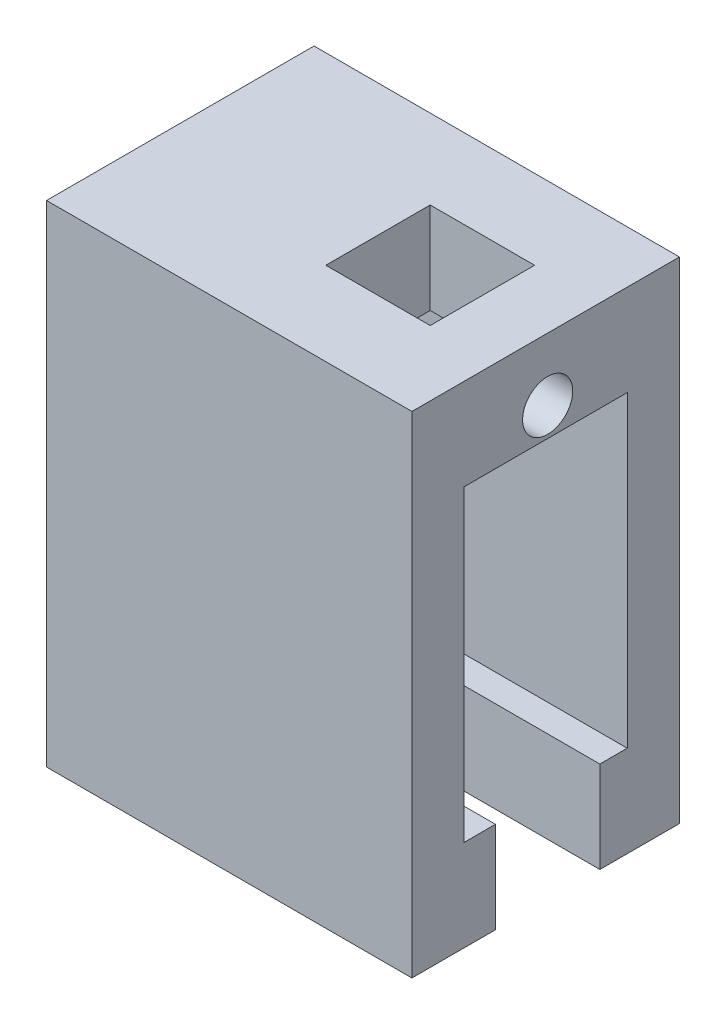
ISO-10303-21;
HEADER;
FILE_DESCRIPTION(('STEP AP214'),'2;1');
FILE_NAME('part.step','',(''),(''),'','','');
FILE_SCHEMA(('AUTOMOTIVE_DESIGN { 1 0 10303 214 1 1 1 1 }'));
ENDSEC;
DATA;
#1=APPLICATION_CONTEXT('core data for automotive mechanical design processes');
#2=APPLICATION_PROTOCOL_DEFINITION('international standard','automotive_design',2000,#1);
#3=PRODUCT_CONTEXT('',#1,'mechanical');
#4=PRODUCT('Part','Part','',(#3));
#5=PRODUCT_RELATED_PRODUCT_CATEGORY('part','',(#4));
#6=PRODUCT_DEFINITION_FORMATION('','',#4);
#7=PRODUCT_DEFINITION_CONTEXT('part definition',#1,'design');
#8=PRODUCT_DEFINITION('design','',#6,#7);
#9=PRODUCT_DEFINITION_SHAPE('','',#8);
#10=(LENGTH_UNIT() NAMED_UNIT(*) SI_UNIT(.MILLI.,.METRE.));
#11=(NAMED_UNIT(*) PLANE_ANGLE_UNIT() SI_UNIT($,.RADIAN.));
#12=(NAMED_UNIT(*) SI_UNIT($,.STERADIAN.) SOLID_ANGLE_UNIT());
#13=UNCERTAINTY_MEASURE_WITH_UNIT(LENGTH_MEASURE(1.E-05),#10,'distance_accuracy_value','');
#14=(GEOMETRIC_REPRESENTATION_CONTEXT(3) GLOBAL_UNCERTAINTY_ASSIGNED_CONTEXT((#13)) GLOBAL_UNIT_ASSIGNED_CONTEXT((#10,
#11,#12)) REPRESENTATION_CONTEXT('',''));
#15=CARTESIAN_POINT('',(0.,0.,0.));
#16=DIRECTION('',(0.,0.,1.));
#17=DIRECTION('',(1.,0.,0.));
#18=AXIS2_PLACEMENT_3D('',#15,#16,#17);
#19=CARTESIAN_POINT('',(28.,0.,0.));
#20=DIRECTION('',(-1.,0.,0.));
#21=DIRECTION('',(0.,0.,1.));
#22=AXIS2_PLACEMENT_3D('',#19,#20,#21);
#23=PLANE('',#22);
#24=CARTESIAN_POINT('',(28.,13.45,0.));
#25=DIRECTION('',(1.,0.,0.));
#26=DIRECTION('',(0.,0.,-1.));
#27=AXIS2_PLACEMENT_3D('',#24,#25,#26);
#28=CIRCLE('',#27,1.92);
#29=CARTESIAN_POINT('',(28.,13.45,-1.92));
#30=VERTEX_POINT('',#29);
#31=EDGE_CURVE('E214',#30,#30,#28,.T.);
#32=ORIENTED_EDGE('',*,*,#31,.F.);
#33=EDGE_LOOP('',(#32));
#34=FACE_BOUND('',#33,.T.);
#35=DIRECTION('',(0.,0.,-1.));
#36=VECTOR('',#35,1.);
#37=CARTESIAN_POINT('',(28.,-19.35,10.4));
#38=LINE('',#37,#36);
#39=CARTESIAN_POINT('',(28.,-19.35,10.4));
#40=VERTEX_POINT('',#39);
#41=CARTESIAN_POINT('',(28.,-19.35,4.));
#42=VERTEX_POINT('',#41);
#43=EDGE_CURVE('E260',#40,#42,#38,.T.);
#44=ORIENTED_EDGE('',*,*,#43,.T.);
#45=DIRECTION('',(0.,-1.,0.));
#46=VECTOR('',#45,1.);
#47=CARTESIAN_POINT('',(28.,-12.35,4.));
#48=LINE('',#47,#46);
#49=CARTESIAN_POINT('',(28.,-12.35,4.));
#50=VERTEX_POINT('',#49);
#51=EDGE_CURVE('E156',#50,#42,#48,.T.);
#52=ORIENTED_EDGE('',*,*,#51,.F.);
#53=DIRECTION('',(0.,0.,-1.));
#54=VECTOR('',#53,1.);
#55=CARTESIAN_POINT('',(28.,-12.35,6.4));
#56=LINE('',#55,#54);
#57=CARTESIAN_POINT('',(28.,-12.35,6.4));
#58=VERTEX_POINT('',#57);
#59=EDGE_CURVE('E227',#58,#50,#56,.T.);
#60=ORIENTED_EDGE('',*,*,#59,.F.);
#61=DIRECTION('',(0.,-1.,0.));
#62=VECTOR('',#61,1.);
#63=CARTESIAN_POINT('',(28.,-12.35,6.4));
#64=LINE('',#63,#62);
#65=CARTESIAN_POINT('',(28.,11.25,6.4));
#66=VERTEX_POINT('',#65);
#67=EDGE_CURVE('E223',#66,#58,#64,.T.);
#68=ORIENTED_EDGE('',*,*,#67,.F.);
#69=DIRECTION('',(0.,0.,1.));
#70=VECTOR('',#69,1.);
#71=CARTESIAN_POINT('',(28.,11.25,6.4));
#72=LINE('',#71,#70);
#73=CARTESIAN_POINT('',(28.,11.25,-6.1));
#74=VERTEX_POINT('',#73);
#75=EDGE_CURVE('E220',#74,#66,#72,.T.);
#76=ORIENTED_EDGE('',*,*,#75,.F.);
#77=DIRECTION('',(0.,1.,0.));
#78=VECTOR('',#77,1.);
#79=CARTESIAN_POINT('',(28.,-12.35,-6.1));
#80=LINE('',#79,#78);
#81=CARTESIAN_POINT('',(28.,-12.35,-6.1));
#82=VERTEX_POINT('',#81);
#83=EDGE_CURVE('E218',#82,#74,#80,.T.);
#84=ORIENTED_EDGE('',*,*,#83,.F.);
#85=CARTESIAN_POINT('',(28.,-12.35,-4.));
#86=VERTEX_POINT('',#85);
#87=EDGE_CURVE('E226',#86,#82,#56,.T.);
#88=ORIENTED_EDGE('',*,*,#87,.F.);
#89=DIRECTION('',(0.,1.,0.));
#90=VECTOR('',#89,1.);
#91=CARTESIAN_POINT('',(28.,-12.35,-4.));
#92=LINE('',#91,#90);
#93=CARTESIAN_POINT('',(28.,-19.35,-4.));
#94=VERTEX_POINT('',#93);
#95=EDGE_CURVE('E169',#94,#86,#92,.T.);
#96=ORIENTED_EDGE('',*,*,#95,.F.);
#97=CARTESIAN_POINT('',(28.,-19.35,-10.1));
#98=VERTEX_POINT('',#97);
#99=EDGE_CURVE('E259',#94,#98,#38,.T.);
#100=ORIENTED_EDGE('',*,*,#99,.T.);
#101=DIRECTION('',(0.,1.,0.));
#102=VECTOR('',#101,1.);
#103=CARTESIAN_POINT('',(28.,-19.35,-10.1));
#104=LINE('',#103,#102);
#105=CARTESIAN_POINT('',(28.,18.25,-10.1));
#106=VERTEX_POINT('',#105);
#107=EDGE_CURVE('E251',#98,#106,#104,.T.);
#108=ORIENTED_EDGE('',*,*,#107,.T.);
#109=DIRECTION('',(0.,0.,1.));
#110=VECTOR('',#109,1.);
#111=CARTESIAN_POINT('',(28.,18.25,10.4));
#112=LINE('',#111,#110);
#113=CARTESIAN_POINT('',(28.,18.25,10.4));
#114=VERTEX_POINT('',#113);
#115=EDGE_CURVE('E254',#106,#114,#112,.T.);
#116=ORIENTED_EDGE('',*,*,#115,.T.);
#117=DIRECTION('',(0.,-1.,0.));
#118=VECTOR('',#117,1.);
#119=CARTESIAN_POINT('',(28.,-19.35,10.4));
#120=LINE('',#119,#118);
#121=EDGE_CURVE('E257',#114,#40,#120,.T.);
#122=ORIENTED_EDGE('',*,*,#121,.T.);
#123=EDGE_LOOP('',(#44,#52,#60,#68,#76,#84,#88,#96,#100,#108,#116,#122));
#124=FACE_BOUND('',#123,.T.);
#125=ADVANCED_FACE('F37',(#34,#124),#23,.F.);
#126=CARTESIAN_POINT('',(0.,0.,0.));
#127=DIRECTION('',(-1.,0.,0.));
#128=DIRECTION('',(0.,0.,1.));
#129=AXIS2_PLACEMENT_3D('',#126,#127,#128);
#130=PLANE('',#129);
#131=DIRECTION('',(0.,1.,0.));
#132=VECTOR('',#131,1.);
#133=CARTESIAN_POINT('',(0.,-19.35,-10.1));
#134=LINE('',#133,#132);
#135=CARTESIAN_POINT('',(0.,-19.35,-10.1));
#136=VERTEX_POINT('',#135);
#137=CARTESIAN_POINT('',(0.,18.25,-10.1));
#138=VERTEX_POINT('',#137);
#139=EDGE_CURVE('E250',#136,#138,#134,.T.);
#140=ORIENTED_EDGE('',*,*,#139,.F.);
#141=DIRECTION('',(0.,0.,-1.));
#142=VECTOR('',#141,1.);
#143=CARTESIAN_POINT('',(0.,-19.35,10.4));
#144=LINE('',#143,#142);
#145=CARTESIAN_POINT('',(0.,-19.35,10.4));
#146=VERTEX_POINT('',#145);
#147=EDGE_CURVE('E255',#146,#136,#144,.T.);
#148=ORIENTED_EDGE('',*,*,#147,.F.);
#149=DIRECTION('',(0.,-1.,0.));
#150=VECTOR('',#149,1.);
#151=CARTESIAN_POINT('',(0.,-19.35,10.4));
#152=LINE('',#151,#150);
#153=CARTESIAN_POINT('',(0.,18.25,10.4));
#154=VERTEX_POINT('',#153);
#155=EDGE_CURVE('E267',#154,#146,#152,.T.);
#156=ORIENTED_EDGE('',*,*,#155,.F.);
#157=DIRECTION('',(0.,0.,1.));
#158=VECTOR('',#157,1.);
#159=CARTESIAN_POINT('',(0.,18.25,10.4));
#160=LINE('',#159,#158);
#161=EDGE_CURVE('E265',#138,#154,#160,.T.);
#162=ORIENTED_EDGE('',*,*,#161,.F.);
#163=EDGE_LOOP('',(#140,#148,#156,#162));
#164=FACE_BOUND('',#163,.T.);
#165=DIRECTION('',(0.,0.,-1.));
#166=VECTOR('',#165,1.);
#167=CARTESIAN_POINT('',(0.,-12.35,6.4));
#168=LINE('',#167,#166);
#169=CARTESIAN_POINT('',(0.,-12.35,6.4));
#170=VERTEX_POINT('',#169);
#171=CARTESIAN_POINT('',(0.,-12.35,-6.1));
#172=VERTEX_POINT('',#171);
#173=EDGE_CURVE('E221',#170,#172,#168,.T.);
#174=ORIENTED_EDGE('',*,*,#173,.T.);
#175=DIRECTION('',(0.,1.,0.));
#176=VECTOR('',#175,1.);
#177=CARTESIAN_POINT('',(0.,-12.35,-6.1));
#178=LINE('',#177,#176);
#179=CARTESIAN_POINT('',(0.,11.25,-6.1));
#180=VERTEX_POINT('',#179);
#181=EDGE_CURVE('E217',#172,#180,#178,.T.);
#182=ORIENTED_EDGE('',*,*,#181,.T.);
#183=DIRECTION('',(0.,0.,1.));
#184=VECTOR('',#183,1.);
#185=CARTESIAN_POINT('',(0.,11.25,6.4));
#186=LINE('',#185,#184);
#187=CARTESIAN_POINT('',(0.,11.25,6.4));
#188=VERTEX_POINT('',#187);
#189=EDGE_CURVE('E233',#180,#188,#186,.T.);
#190=ORIENTED_EDGE('',*,*,#189,.T.);
#191=DIRECTION('',(0.,-1.,0.));
#192=VECTOR('',#191,1.);
#193=CARTESIAN_POINT('',(0.,-12.35,6.4));
#194=LINE('',#193,#192);
#195=EDGE_CURVE('E236',#188,#170,#194,.T.);
#196=ORIENTED_EDGE('',*,*,#195,.T.);
#197=EDGE_LOOP('',(#174,#182,#190,#196));
#198=FACE_BOUND('',#197,.T.);
#199=ADVANCED_FACE('F286',(#164,#198),#130,.T.);
#200=CARTESIAN_POINT('',(28.,-19.35,-10.1));
#201=DIRECTION('',(0.,0.,1.));
#202=DIRECTION('',(1.,0.,0.));
#203=AXIS2_PLACEMENT_3D('',#200,#201,#202);
#204=PLANE('',#203);
#205=ORIENTED_EDGE('',*,*,#139,.T.);
#206=DIRECTION('',(-1.,0.,0.));
#207=VECTOR('',#206,1.);
#208=CARTESIAN_POINT('',(28.,18.25,-10.1));
#209=LINE('',#208,#207);
#210=EDGE_CURVE('E11',#106,#138,#209,.T.);
#211=ORIENTED_EDGE('',*,*,#210,.F.);
#212=ORIENTED_EDGE('',*,*,#107,.F.);
#213=DIRECTION('',(-1.,0.,0.));
#214=VECTOR('',#213,1.);
#215=CARTESIAN_POINT('',(28.,-19.35,-10.1));
#216=LINE('',#215,#214);
#217=EDGE_CURVE('E262',#98,#136,#216,.T.);
#218=ORIENTED_EDGE('',*,*,#217,.T.);
#219=EDGE_LOOP('',(#205,#211,#212,#218));
#220=FACE_BOUND('',#219,.T.);
#221=ADVANCED_FACE('F39',(#220),#204,.F.);
#222=CARTESIAN_POINT('',(28.,18.25,10.4));
#223=DIRECTION('',(0.,-1.,0.));
#224=DIRECTION('',(0.,0.,-1.));
#225=AXIS2_PLACEMENT_3D('',#222,#223,#224);
#226=PLANE('',#225);
#227=DIRECTION('',(-1.,0.,0.));
#228=VECTOR('',#227,1.);
#229=CARTESIAN_POINT('',(23.,18.25,-4.));
#230=LINE('',#229,#228);
#231=CARTESIAN_POINT('',(23.,18.25,-4.));
#232=VERTEX_POINT('',#231);
#233=CARTESIAN_POINT('',(15.,18.25,-4.));
#234=VERTEX_POINT('',#233);
#235=EDGE_CURVE('E61',#232,#234,#230,.T.);
#236=ORIENTED_EDGE('',*,*,#235,.F.);
#237=DIRECTION('',(0.,0.,1.));
#238=VECTOR('',#237,1.);
#239=CARTESIAN_POINT('',(23.,18.25,4.));
#240=LINE('',#239,#238);
#241=CARTESIAN_POINT('',(23.,18.25,4.));
#242=VERTEX_POINT('',#241);
#243=EDGE_CURVE('E192',#232,#242,#240,.T.);
#244=ORIENTED_EDGE('',*,*,#243,.T.);
#245=DIRECTION('',(-1.,0.,0.));
#246=VECTOR('',#245,1.);
#247=CARTESIAN_POINT('',(23.,18.25,4.));
#248=LINE('',#247,#246);
#249=CARTESIAN_POINT('',(15.,18.25,4.));
#250=VERTEX_POINT('',#249);
#251=EDGE_CURVE('E207',#242,#250,#248,.T.);
#252=ORIENTED_EDGE('',*,*,#251,.T.);
#253=DIRECTION('',(0.,0.,1.));
#254=VECTOR('',#253,1.);
#255=CARTESIAN_POINT('',(15.,18.25,4.));
#256=LINE('',#255,#254);
#257=EDGE_CURVE('E202',#234,#250,#256,.T.);
#258=ORIENTED_EDGE('',*,*,#257,.F.);
#259=EDGE_LOOP('',(#236,#244,#252,#258));
#260=FACE_BOUND('',#259,.T.);
#261=ORIENTED_EDGE('',*,*,#161,.T.);
#262=DIRECTION('',(-1.,0.,0.));
#263=VECTOR('',#262,1.);
#264=CARTESIAN_POINT('',(28.,18.25,10.4));
#265=LINE('',#264,#263);
#266=EDGE_CURVE('E46',#114,#154,#265,.T.);
#267=ORIENTED_EDGE('',*,*,#266,.F.);
#268=ORIENTED_EDGE('',*,*,#115,.F.);
#269=ORIENTED_EDGE('',*,*,#210,.T.);
#270=EDGE_LOOP('',(#261,#267,#268,#269));
#271=FACE_BOUND('',#270,.T.);
#272=ADVANCED_FACE('F320',(#260,#271),#226,.F.);
#273=CARTESIAN_POINT('',(28.,-19.35,10.4));
#274=DIRECTION('',(0.,0.,-1.));
#275=DIRECTION('',(-1.,0.,0.));
#276=AXIS2_PLACEMENT_3D('',#273,#274,#275);
#277=PLANE('',#276);
#278=ORIENTED_EDGE('',*,*,#155,.T.);
#279=DIRECTION('',(-1.,0.,0.));
#280=VECTOR('',#279,1.);
#281=CARTESIAN_POINT('',(28.,-19.35,10.4));
#282=LINE('',#281,#280);
#283=EDGE_CURVE('E272',#40,#146,#282,.T.);
#284=ORIENTED_EDGE('',*,*,#283,.F.);
#285=ORIENTED_EDGE('',*,*,#121,.F.);
#286=ORIENTED_EDGE('',*,*,#266,.T.);
#287=EDGE_LOOP('',(#278,#284,#285,#286));
#288=FACE_BOUND('',#287,.T.);
#289=ADVANCED_FACE('F280',(#288),#277,.F.);
#290=CARTESIAN_POINT('',(28.,-19.35,10.4));
#291=DIRECTION('',(0.,1.,0.));
#292=DIRECTION('',(0.,0.,1.));
#293=AXIS2_PLACEMENT_3D('',#290,#291,#292);
#294=PLANE('',#293);
#295=DIRECTION('',(0.,0.,-1.));
#296=VECTOR('',#295,1.);
#297=CARTESIAN_POINT('',(8.,-19.35,4.));
#298=LINE('',#297,#296);
#299=CARTESIAN_POINT('',(8.,-19.35,4.));
#300=VERTEX_POINT('',#299);
#301=CARTESIAN_POINT('',(8.,-19.35,-4.));
#302=VERTEX_POINT('',#301);
#303=EDGE_CURVE('E165',#300,#302,#298,.T.);
#304=ORIENTED_EDGE('',*,*,#303,.F.);
#305=DIRECTION('',(1.,0.,0.));
#306=VECTOR('',#305,1.);
#307=CARTESIAN_POINT('',(8.,-19.35,4.));
#308=LINE('',#307,#306);
#309=EDGE_CURVE('E151',#300,#42,#308,.T.);
#310=ORIENTED_EDGE('',*,*,#309,.T.);
#311=ORIENTED_EDGE('',*,*,#43,.F.);
#312=ORIENTED_EDGE('',*,*,#283,.T.);
#313=ORIENTED_EDGE('',*,*,#147,.T.);
#314=ORIENTED_EDGE('',*,*,#217,.F.);
#315=ORIENTED_EDGE('',*,*,#99,.F.);
#316=DIRECTION('',(1.,0.,0.));
#317=VECTOR('',#316,1.);
#318=CARTESIAN_POINT('',(8.,-19.35,-4.));
#319=LINE('',#318,#317);
#320=EDGE_CURVE('E161',#302,#94,#319,.T.);
#321=ORIENTED_EDGE('',*,*,#320,.F.);
#322=EDGE_LOOP('',(#304,#310,#311,#312,#313,#314,#315,#321));
#323=FACE_BOUND('',#322,.T.);
#324=ADVANCED_FACE('F171',(#323),#294,.F.);
#325=CARTESIAN_POINT('',(28.,-12.35,-6.1));
#326=DIRECTION('',(0.,0.,1.));
#327=DIRECTION('',(1.,0.,0.));
#328=AXIS2_PLACEMENT_3D('',#325,#326,#327);
#329=PLANE('',#328);
#330=ORIENTED_EDGE('',*,*,#181,.F.);
#331=DIRECTION('',(-1.,0.,0.));
#332=VECTOR('',#331,1.);
#333=CARTESIAN_POINT('',(28.,-12.35,-6.1));
#334=LINE('',#333,#332);
#335=EDGE_CURVE('E230',#82,#172,#334,.T.);
#336=ORIENTED_EDGE('',*,*,#335,.F.);
#337=ORIENTED_EDGE('',*,*,#83,.T.);
#338=DIRECTION('',(-1.,0.,0.));
#339=VECTOR('',#338,1.);
#340=CARTESIAN_POINT('',(28.,11.25,-6.1));
#341=LINE('',#340,#339);
#342=EDGE_CURVE('E247',#74,#180,#341,.T.);
#343=ORIENTED_EDGE('',*,*,#342,.T.);
#344=EDGE_LOOP('',(#330,#336,#337,#343));
#345=FACE_BOUND('',#344,.T.);
#346=ADVANCED_FACE('F313',(#345),#329,.T.);
#347=CARTESIAN_POINT('',(28.,11.25,6.4));
#348=DIRECTION('',(0.,-1.,0.));
#349=DIRECTION('',(0.,0.,-1.));
#350=AXIS2_PLACEMENT_3D('',#347,#348,#349);
#351=PLANE('',#350);
#352=DIRECTION('',(0.,0.,-1.));
#353=VECTOR('',#352,1.);
#354=CARTESIAN_POINT('',(23.,11.25,4.));
#355=LINE('',#354,#353);
#356=CARTESIAN_POINT('',(23.,11.25,4.));
#357=VERTEX_POINT('',#356);
#358=CARTESIAN_POINT('',(23.,11.25,-4.));
#359=VERTEX_POINT('',#358);
#360=EDGE_CURVE('E186',#357,#359,#355,.T.);
#361=ORIENTED_EDGE('',*,*,#360,.T.);
#362=DIRECTION('',(-1.,0.,0.));
#363=VECTOR('',#362,1.);
#364=CARTESIAN_POINT('',(23.,11.25,-4.));
#365=LINE('',#364,#363);
#366=CARTESIAN_POINT('',(15.,11.25,-4.));
#367=VERTEX_POINT('',#366);
#368=EDGE_CURVE('E211',#359,#367,#365,.T.);
#369=ORIENTED_EDGE('',*,*,#368,.T.);
#370=DIRECTION('',(0.,0.,-1.));
#371=VECTOR('',#370,1.);
#372=CARTESIAN_POINT('',(15.,11.25,4.));
#373=LINE('',#372,#371);
#374=CARTESIAN_POINT('',(15.,11.25,4.));
#375=VERTEX_POINT('',#374);
#376=EDGE_CURVE('E181',#375,#367,#373,.T.);
#377=ORIENTED_EDGE('',*,*,#376,.F.);
#378=DIRECTION('',(-1.,0.,0.));
#379=VECTOR('',#378,1.);
#380=CARTESIAN_POINT('',(23.,11.25,4.));
#381=LINE('',#380,#379);
#382=EDGE_CURVE('E197',#357,#375,#381,.T.);
#383=ORIENTED_EDGE('',*,*,#382,.F.);
#384=EDGE_LOOP('',(#361,#369,#377,#383));
#385=FACE_BOUND('',#384,.T.);
#386=ORIENTED_EDGE('',*,*,#189,.F.);
#387=ORIENTED_EDGE('',*,*,#342,.F.);
#388=ORIENTED_EDGE('',*,*,#75,.T.);
#389=DIRECTION('',(-1.,0.,0.));
#390=VECTOR('',#389,1.);
#391=CARTESIAN_POINT('',(28.,11.25,6.4));
#392=LINE('',#391,#390);
#393=EDGE_CURVE('E245',#66,#188,#392,.T.);
#394=ORIENTED_EDGE('',*,*,#393,.T.);
#395=EDGE_LOOP('',(#386,#387,#388,#394));
#396=FACE_BOUND('',#395,.T.);
#397=ADVANCED_FACE('F310',(#385,#396),#351,.T.);
#398=CARTESIAN_POINT('',(28.,-12.35,6.4));
#399=DIRECTION('',(0.,0.,-1.));
#400=DIRECTION('',(-1.,0.,0.));
#401=AXIS2_PLACEMENT_3D('',#398,#399,#400);
#402=PLANE('',#401);
#403=ORIENTED_EDGE('',*,*,#195,.F.);
#404=ORIENTED_EDGE('',*,*,#393,.F.);
#405=ORIENTED_EDGE('',*,*,#67,.T.);
#406=DIRECTION('',(-1.,0.,0.));
#407=VECTOR('',#406,1.);
#408=CARTESIAN_POINT('',(28.,-12.35,6.4));
#409=LINE('',#408,#407);
#410=EDGE_CURVE('E243',#58,#170,#409,.T.);
#411=ORIENTED_EDGE('',*,*,#410,.T.);
#412=EDGE_LOOP('',(#403,#404,#405,#411));
#413=FACE_BOUND('',#412,.T.);
#414=ADVANCED_FACE('F307',(#413),#402,.T.);
#415=CARTESIAN_POINT('',(28.,-12.35,6.4));
#416=DIRECTION('',(0.,1.,0.));
#417=DIRECTION('',(0.,0.,1.));
#418=AXIS2_PLACEMENT_3D('',#415,#416,#417);
#419=PLANE('',#418);
#420=DIRECTION('',(1.,0.,0.));
#421=VECTOR('',#420,1.);
#422=CARTESIAN_POINT('',(8.,-12.35,4.));
#423=LINE('',#422,#421);
#424=CARTESIAN_POINT('',(8.,-12.35,4.));
#425=VERTEX_POINT('',#424);
#426=EDGE_CURVE('E179',#425,#50,#423,.T.);
#427=ORIENTED_EDGE('',*,*,#426,.F.);
#428=DIRECTION('',(0.,0.,1.));
#429=VECTOR('',#428,1.);
#430=CARTESIAN_POINT('',(8.,-12.35,-4.));
#431=LINE('',#430,#429);
#432=CARTESIAN_POINT('',(8.,-12.35,-4.));
#433=VERTEX_POINT('',#432);
#434=EDGE_CURVE('E162',#433,#425,#431,.T.);
#435=ORIENTED_EDGE('',*,*,#434,.F.);
#436=DIRECTION('',(1.,0.,0.));
#437=VECTOR('',#436,1.);
#438=CARTESIAN_POINT('',(8.,-12.35,-4.));
#439=LINE('',#438,#437);
#440=EDGE_CURVE('E182',#433,#86,#439,.T.);
#441=ORIENTED_EDGE('',*,*,#440,.T.);
#442=ORIENTED_EDGE('',*,*,#87,.T.);
#443=ORIENTED_EDGE('',*,*,#335,.T.);
#444=ORIENTED_EDGE('',*,*,#173,.F.);
#445=ORIENTED_EDGE('',*,*,#410,.F.);
#446=ORIENTED_EDGE('',*,*,#59,.T.);
#447=EDGE_LOOP('',(#427,#435,#441,#442,#443,#444,#445,#446));
#448=FACE_BOUND('',#447,.T.);
#449=ADVANCED_FACE('F299',(#448),#419,.T.);
#450=CARTESIAN_POINT('',(15.,13.45,0.));
#451=DIRECTION('',(1.,0.,0.));
#452=DIRECTION('',(0.,0.,-1.));
#453=AXIS2_PLACEMENT_3D('',#450,#451,#452);
#454=CYLINDRICAL_SURFACE('',#453,1.92);
#455=CARTESIAN_POINT('',(23.,13.45,0.));
#456=DIRECTION('',(1.,0.,0.));
#457=DIRECTION('',(0.,0.,-1.));
#458=AXIS2_PLACEMENT_3D('',#455,#456,#457);
#459=CIRCLE('',#458,1.92);
#460=CARTESIAN_POINT('',(23.,13.45,-1.92));
#461=VERTEX_POINT('',#460);
#462=EDGE_CURVE('E41',#461,#461,#459,.F.);
#463=ORIENTED_EDGE('',*,*,#462,.T.);
#464=EDGE_LOOP('',(#463));
#465=FACE_BOUND('',#464,.T.);
#466=ORIENTED_EDGE('',*,*,#31,.T.);
#467=EDGE_LOOP('',(#466));
#468=FACE_BOUND('',#467,.T.);
#469=ADVANCED_FACE('F350',(#465,#468),#454,.F.);
#470=CARTESIAN_POINT('',(23.,0.,0.));
#471=DIRECTION('',(1.,0.,0.));
#472=DIRECTION('',(0.,0.,-1.));
#473=AXIS2_PLACEMENT_3D('',#470,#471,#472);
#474=PLANE('',#473);
#475=ORIENTED_EDGE('',*,*,#360,.F.);
#476=DIRECTION('',(0.,-1.,0.));
#477=VECTOR('',#476,1.);
#478=CARTESIAN_POINT('',(23.,11.25,4.));
#479=LINE('',#478,#477);
#480=EDGE_CURVE('E195',#242,#357,#479,.T.);
#481=ORIENTED_EDGE('',*,*,#480,.F.);
#482=ORIENTED_EDGE('',*,*,#243,.F.);
#483=DIRECTION('',(0.,1.,0.));
#484=VECTOR('',#483,1.);
#485=CARTESIAN_POINT('',(23.,11.25,-4.));
#486=LINE('',#485,#484);
#487=EDGE_CURVE('E189',#359,#232,#486,.T.);
#488=ORIENTED_EDGE('',*,*,#487,.F.);
#489=EDGE_LOOP('',(#475,#481,#482,#488));
#490=FACE_BOUND('',#489,.T.);
#491=ORIENTED_EDGE('',*,*,#462,.F.);
#492=EDGE_LOOP('',(#491));
#493=FACE_BOUND('',#492,.T.);
#494=ADVANCED_FACE('F347',(#490,#493),#474,.F.);
#495=CARTESIAN_POINT('',(23.,11.25,-4.));
#496=DIRECTION('',(0.,0.,1.));
#497=DIRECTION('',(0.,-1.,0.));
#498=AXIS2_PLACEMENT_3D('',#495,#496,#497);
#499=PLANE('',#498);
#500=DIRECTION('',(0.,1.,0.));
#501=VECTOR('',#500,1.);
#502=CARTESIAN_POINT('',(15.,11.25,-4.));
#503=LINE('',#502,#501);
#504=EDGE_CURVE('E200',#367,#234,#503,.T.);
#505=ORIENTED_EDGE('',*,*,#504,.F.);
#506=ORIENTED_EDGE('',*,*,#368,.F.);
#507=ORIENTED_EDGE('',*,*,#487,.T.);
#508=ORIENTED_EDGE('',*,*,#235,.T.);
#509=EDGE_LOOP('',(#505,#506,#507,#508));
#510=FACE_BOUND('',#509,.T.);
#511=ADVANCED_FACE('F345',(#510),#499,.T.);
#512=CARTESIAN_POINT('',(23.,11.25,4.));
#513=DIRECTION('',(0.,0.,-1.));
#514=DIRECTION('',(0.,1.,0.));
#515=AXIS2_PLACEMENT_3D('',#512,#513,#514);
#516=PLANE('',#515);
#517=DIRECTION('',(0.,-1.,0.));
#518=VECTOR('',#517,1.);
#519=CARTESIAN_POINT('',(15.,11.25,4.));
#520=LINE('',#519,#518);
#521=EDGE_CURVE('E190',#250,#375,#520,.T.);
#522=ORIENTED_EDGE('',*,*,#521,.F.);
#523=ORIENTED_EDGE('',*,*,#251,.F.);
#524=ORIENTED_EDGE('',*,*,#480,.T.);
#525=ORIENTED_EDGE('',*,*,#382,.T.);
#526=EDGE_LOOP('',(#522,#523,#524,#525));
#527=FACE_BOUND('',#526,.T.);
#528=ADVANCED_FACE('F339',(#527),#516,.T.);
#529=CARTESIAN_POINT('',(15.,13.45,0.));
#530=DIRECTION('',(1.,0.,0.));
#531=DIRECTION('',(0.,0.,-1.));
#532=AXIS2_PLACEMENT_3D('',#529,#530,#531);
#533=PLANE('',#532);
#534=ORIENTED_EDGE('',*,*,#376,.T.);
#535=ORIENTED_EDGE('',*,*,#504,.T.);
#536=ORIENTED_EDGE('',*,*,#257,.T.);
#537=ORIENTED_EDGE('',*,*,#521,.T.);
#538=EDGE_LOOP('',(#534,#535,#536,#537));
#539=FACE_BOUND('',#538,.T.);
#540=ADVANCED_FACE('F336',(#539),#533,.T.);
#541=CARTESIAN_POINT('',(8.,-12.35,4.));
#542=DIRECTION('',(0.,0.,1.));
#543=DIRECTION('',(0.,-1.,0.));
#544=AXIS2_PLACEMENT_3D('',#541,#542,#543);
#545=PLANE('',#544);
#546=ORIENTED_EDGE('',*,*,#51,.T.);
#547=ORIENTED_EDGE('',*,*,#309,.F.);
#548=DIRECTION('',(0.,-1.,0.));
#549=VECTOR('',#548,1.);
#550=CARTESIAN_POINT('',(8.,-12.35,4.));
#551=LINE('',#550,#549);
#552=EDGE_CURVE('E154',#425,#300,#551,.T.);
#553=ORIENTED_EDGE('',*,*,#552,.F.);
#554=ORIENTED_EDGE('',*,*,#426,.T.);
#555=EDGE_LOOP('',(#546,#547,#553,#554));
#556=FACE_BOUND('',#555,.T.);
#557=ADVANCED_FACE('F153',(#556),#545,.F.);
#558=CARTESIAN_POINT('',(8.,-12.35,-4.));
#559=DIRECTION('',(0.,0.,-1.));
#560=DIRECTION('',(0.,1.,0.));
#561=AXIS2_PLACEMENT_3D('',#558,#559,#560);
#562=PLANE('',#561);
#563=ORIENTED_EDGE('',*,*,#95,.T.);
#564=ORIENTED_EDGE('',*,*,#440,.F.);
#565=DIRECTION('',(0.,1.,0.));
#566=VECTOR('',#565,1.);
#567=CARTESIAN_POINT('',(8.,-12.35,-4.));
#568=LINE('',#567,#566);
#569=EDGE_CURVE('E53',#302,#433,#568,.T.);
#570=ORIENTED_EDGE('',*,*,#569,.F.);
#571=ORIENTED_EDGE('',*,*,#320,.T.);
#572=EDGE_LOOP('',(#563,#564,#570,#571));
#573=FACE_BOUND('',#572,.T.);
#574=ADVANCED_FACE('F297',(#573),#562,.F.);
#575=CARTESIAN_POINT('',(8.,0.,0.));
#576=DIRECTION('',(1.,0.,0.));
#577=DIRECTION('',(0.,0.,-1.));
#578=AXIS2_PLACEMENT_3D('',#575,#576,#577);
#579=PLANE('',#578);
#580=ORIENTED_EDGE('',*,*,#552,.T.);
#581=ORIENTED_EDGE('',*,*,#303,.T.);
#582=ORIENTED_EDGE('',*,*,#569,.T.);
#583=ORIENTED_EDGE('',*,*,#434,.T.);
#584=EDGE_LOOP('',(#580,#581,#582,#583));
#585=FACE_BOUND('',#584,.T.);
#586=ADVANCED_FACE('F164',(#585),#579,.T.);
#587=CLOSED_SHELL('',(#125,#199,#221,#272,#289,#324,#346,#397,#414,#449,#469,#494,#511,#528,
#540,#557,#574,#586));
#588=MANIFOLD_SOLID_BREP('B2',#587);
#589=ADVANCED_BREP_SHAPE_REPRESENTATION('',(#18,#588),#14);
#590=SHAPE_DEFINITION_REPRESENTATION(#9,#589);
ENDSEC;
END-ISO-10303-21;
